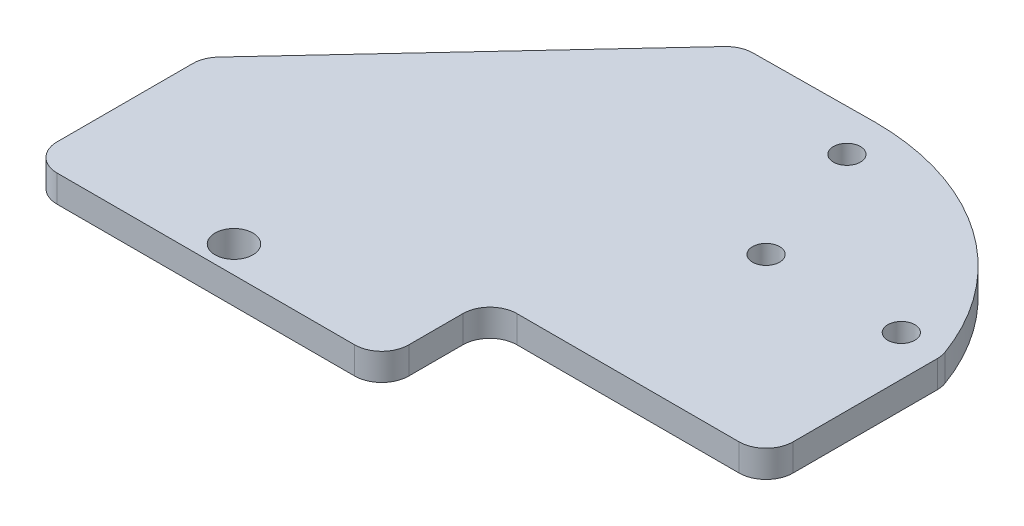
ISO-10303-21;
HEADER;
FILE_DESCRIPTION(('STEP AP214'),'2;1');
FILE_NAME('part.step','',(''),(''),'','','');
FILE_SCHEMA(('AUTOMOTIVE_DESIGN { 1 0 10303 214 1 1 1 1 }'));
ENDSEC;
DATA;
#1=APPLICATION_CONTEXT('core data for automotive mechanical design processes');
#2=APPLICATION_PROTOCOL_DEFINITION('international standard','automotive_design',2000,#1);
#3=PRODUCT_CONTEXT('',#1,'mechanical');
#4=PRODUCT('Part','Part','',(#3));
#5=PRODUCT_RELATED_PRODUCT_CATEGORY('part','',(#4));
#6=PRODUCT_DEFINITION_FORMATION('','',#4);
#7=PRODUCT_DEFINITION_CONTEXT('part definition',#1,'design');
#8=PRODUCT_DEFINITION('design','',#6,#7);
#9=PRODUCT_DEFINITION_SHAPE('','',#8);
#10=(LENGTH_UNIT() NAMED_UNIT(*) SI_UNIT(.MILLI.,.METRE.));
#11=(NAMED_UNIT(*) PLANE_ANGLE_UNIT() SI_UNIT($,.RADIAN.));
#12=(NAMED_UNIT(*) SI_UNIT($,.STERADIAN.) SOLID_ANGLE_UNIT());
#13=UNCERTAINTY_MEASURE_WITH_UNIT(LENGTH_MEASURE(1.E-05),#10,'distance_accuracy_value','');
#14=(GEOMETRIC_REPRESENTATION_CONTEXT(3) GLOBAL_UNCERTAINTY_ASSIGNED_CONTEXT((#13)) GLOBAL_UNIT_ASSIGNED_CONTEXT((#10,
#11,#12)) REPRESENTATION_CONTEXT('',''));
#15=CARTESIAN_POINT('',(0.,0.,0.));
#16=DIRECTION('',(0.,0.,1.));
#17=DIRECTION('',(1.,0.,0.));
#18=AXIS2_PLACEMENT_3D('',#15,#16,#17);
#19=CARTESIAN_POINT('',(-34.7983001151033,10.,-117.080751783085));
#20=DIRECTION('',(0.,-1.,0.));
#21=DIRECTION('',(0.,0.,-1.));
#22=AXIS2_PLACEMENT_3D('',#19,#20,#21);
#23=CYLINDRICAL_SURFACE('',#22,9.99999999999999);
#24=CARTESIAN_POINT('',(-34.7983001151033,0.,-117.080751783085));
#25=DIRECTION('',(0.,1.,0.));
#26=DIRECTION('',(0.,0.,-1.));
#27=AXIS2_PLACEMENT_3D('',#24,#25,#26);
#28=CIRCLE('',#27,9.99999999999999);
#29=CARTESIAN_POINT('',(-34.9535044317094,0.,-127.07954729155));
#30=VERTEX_POINT('',#29);
#31=CARTESIAN_POINT('',(-42.1194135361715,0.,-123.892601625518));
#32=VERTEX_POINT('',#31);
#33=EDGE_CURVE('E177',#30,#32,#28,.T.);
#34=ORIENTED_EDGE('',*,*,#33,.T.);
#35=DIRECTION('',(0.,-1.,0.));
#36=VECTOR('',#35,1.);
#37=CARTESIAN_POINT('',(-42.1194135361715,10.,-123.892601625518));
#38=LINE('',#37,#36);
#39=CARTESIAN_POINT('',(-42.1194135361715,10.,-123.892601625518));
#40=VERTEX_POINT('',#39);
#41=EDGE_CURVE('E11',#40,#32,#38,.T.);
#42=ORIENTED_EDGE('',*,*,#41,.F.);
#43=CARTESIAN_POINT('',(-34.7983001151033,10.,-117.080751783085));
#44=DIRECTION('',(0.,1.,0.));
#45=DIRECTION('',(0.,0.,-1.));
#46=AXIS2_PLACEMENT_3D('',#43,#44,#45);
#47=CIRCLE('',#46,9.99999999999999);
#48=CARTESIAN_POINT('',(-34.9535044317094,10.,-127.07954729155));
#49=VERTEX_POINT('',#48);
#50=EDGE_CURVE('E205',#49,#40,#47,.T.);
#51=ORIENTED_EDGE('',*,*,#50,.F.);
#52=DIRECTION('',(0.,-1.,0.));
#53=VECTOR('',#52,1.);
#54=CARTESIAN_POINT('',(-34.9535044317094,10.,-127.07954729155));
#55=LINE('',#54,#53);
#56=EDGE_CURVE('E173',#49,#30,#55,.T.);
#57=ORIENTED_EDGE('',*,*,#56,.T.);
#58=EDGE_LOOP('',(#34,#42,#51,#57));
#59=FACE_BOUND('',#58,.T.);
#60=ADVANCED_FACE('F37',(#59),#23,.T.);
#61=CARTESIAN_POINT('',(-132.321113421068,10.,-26.9472944173652));
#62=DIRECTION('',(0.732111342106818,0.,0.681184984243307));
#63=DIRECTION('',(0.681184984243307,0.,-0.732111342106818));
#64=AXIS2_PLACEMENT_3D('',#61,#62,#63);
#65=PLANE('',#64);
#66=DIRECTION('',(-0.681184984243307,0.,0.732111342106818));
#67=VECTOR('',#66,1.);
#68=CARTESIAN_POINT('',(-132.321113421068,0.,-26.9472944173652));
#69=LINE('',#68,#67);
#70=CARTESIAN_POINT('',(-132.321113421068,0.,-26.9472944173652));
#71=VERTEX_POINT('',#70);
#72=EDGE_CURVE('E180',#32,#71,#69,.T.);
#73=ORIENTED_EDGE('',*,*,#72,.T.);
#74=DIRECTION('',(0.,-1.,0.));
#75=VECTOR('',#74,1.);
#76=CARTESIAN_POINT('',(-132.321113421068,10.,-26.9472944173652));
#77=LINE('',#76,#75);
#78=CARTESIAN_POINT('',(-132.321113421068,10.,-26.9472944173652));
#79=VERTEX_POINT('',#78);
#80=EDGE_CURVE('E46',#79,#71,#77,.T.);
#81=ORIENTED_EDGE('',*,*,#80,.F.);
#82=DIRECTION('',(-0.681184984243307,0.,0.732111342106818));
#83=VECTOR('',#82,1.);
#84=CARTESIAN_POINT('',(-132.321113421068,10.,-26.9472944173652));
#85=LINE('',#84,#83);
#86=EDGE_CURVE('E119',#40,#79,#85,.T.);
#87=ORIENTED_EDGE('',*,*,#86,.F.);
#88=ORIENTED_EDGE('',*,*,#41,.T.);
#89=EDGE_LOOP('',(#73,#81,#87,#88));
#90=FACE_BOUND('',#89,.T.);
#91=ADVANCED_FACE('F276',(#90),#65,.F.);
#92=CARTESIAN_POINT('',(-125.,10.,-20.1354445749322));
#93=DIRECTION('',(0.,-1.,0.));
#94=DIRECTION('',(0.,0.,-1.));
#95=AXIS2_PLACEMENT_3D('',#92,#93,#94);
#96=CYLINDRICAL_SURFACE('',#95,9.99999999999999);
#97=CARTESIAN_POINT('',(-125.,0.,-20.1354445749322));
#98=DIRECTION('',(0.,1.,0.));
#99=DIRECTION('',(0.,0.,-1.));
#100=AXIS2_PLACEMENT_3D('',#97,#98,#99);
#101=CIRCLE('',#100,9.99999999999999);
#102=CARTESIAN_POINT('',(-135.,0.,-20.1354445749321));
#103=VERTEX_POINT('',#102);
#104=EDGE_CURVE('E182',#71,#103,#101,.T.);
#105=ORIENTED_EDGE('',*,*,#104,.T.);
#106=DIRECTION('',(0.,-1.,0.));
#107=VECTOR('',#106,1.);
#108=CARTESIAN_POINT('',(-135.,10.,-20.1354445749321));
#109=LINE('',#108,#107);
#110=CARTESIAN_POINT('',(-135.,10.,-20.1354445749321));
#111=VERTEX_POINT('',#110);
#112=EDGE_CURVE('E233',#111,#103,#109,.T.);
#113=ORIENTED_EDGE('',*,*,#112,.F.);
#114=CARTESIAN_POINT('',(-125.,10.,-20.1354445749322));
#115=DIRECTION('',(0.,1.,0.));
#116=DIRECTION('',(0.,0.,-1.));
#117=AXIS2_PLACEMENT_3D('',#114,#115,#116);
#118=CIRCLE('',#117,9.99999999999999);
#119=EDGE_CURVE('E408',#79,#111,#118,.T.);
#120=ORIENTED_EDGE('',*,*,#119,.F.);
#121=ORIENTED_EDGE('',*,*,#80,.T.);
#122=EDGE_LOOP('',(#105,#113,#120,#121));
#123=FACE_BOUND('',#122,.T.);
#124=ADVANCED_FACE('F280',(#123),#96,.T.);
#125=CARTESIAN_POINT('',(-135.,10.,30.0000000000002));
#126=DIRECTION('',(1.,0.,0.));
#127=DIRECTION('',(0.,0.,-1.));
#128=AXIS2_PLACEMENT_3D('',#125,#126,#127);
#129=PLANE('',#128);
#130=DIRECTION('',(0.,0.,1.));
#131=VECTOR('',#130,1.);
#132=CARTESIAN_POINT('',(-135.,0.,30.0000000000002));
#133=LINE('',#132,#131);
#134=CARTESIAN_POINT('',(-135.,0.,30.0000000000002));
#135=VERTEX_POINT('',#134);
#136=EDGE_CURVE('E184',#103,#135,#133,.T.);
#137=ORIENTED_EDGE('',*,*,#136,.T.);
#138=DIRECTION('',(0.,-1.,0.));
#139=VECTOR('',#138,1.);
#140=CARTESIAN_POINT('',(-135.,10.,30.0000000000002));
#141=LINE('',#140,#139);
#142=CARTESIAN_POINT('',(-135.,10.,30.0000000000002));
#143=VERTEX_POINT('',#142);
#144=EDGE_CURVE('E230',#143,#135,#141,.T.);
#145=ORIENTED_EDGE('',*,*,#144,.F.);
#146=DIRECTION('',(0.,0.,1.));
#147=VECTOR('',#146,1.);
#148=CARTESIAN_POINT('',(-135.,10.,30.0000000000002));
#149=LINE('',#148,#147);
#150=EDGE_CURVE('E410',#111,#143,#149,.T.);
#151=ORIENTED_EDGE('',*,*,#150,.F.);
#152=ORIENTED_EDGE('',*,*,#112,.T.);
#153=EDGE_LOOP('',(#137,#145,#151,#152));
#154=FACE_BOUND('',#153,.T.);
#155=ADVANCED_FACE('F284',(#154),#129,.F.);
#156=CARTESIAN_POINT('',(-125.,10.,30.0000000000002));
#157=DIRECTION('',(0.,-1.,0.));
#158=DIRECTION('',(0.,0.,-1.));
#159=AXIS2_PLACEMENT_3D('',#156,#157,#158);
#160=CYLINDRICAL_SURFACE('',#159,10.);
#161=CARTESIAN_POINT('',(-125.,0.,30.0000000000002));
#162=DIRECTION('',(0.,1.,0.));
#163=DIRECTION('',(0.,0.,-1.));
#164=AXIS2_PLACEMENT_3D('',#161,#162,#163);
#165=CIRCLE('',#164,10.);
#166=CARTESIAN_POINT('',(-125.,0.,40.0000000000002));
#167=VERTEX_POINT('',#166);
#168=EDGE_CURVE('E186',#135,#167,#165,.T.);
#169=ORIENTED_EDGE('',*,*,#168,.T.);
#170=DIRECTION('',(0.,-1.,0.));
#171=VECTOR('',#170,1.);
#172=CARTESIAN_POINT('',(-125.,10.,40.0000000000002));
#173=LINE('',#172,#171);
#174=CARTESIAN_POINT('',(-125.,10.,40.0000000000002));
#175=VERTEX_POINT('',#174);
#176=EDGE_CURVE('E227',#175,#167,#173,.T.);
#177=ORIENTED_EDGE('',*,*,#176,.F.);
#178=CARTESIAN_POINT('',(-125.,10.,30.0000000000002));
#179=DIRECTION('',(0.,1.,0.));
#180=DIRECTION('',(0.,0.,-1.));
#181=AXIS2_PLACEMENT_3D('',#178,#179,#180);
#182=CIRCLE('',#181,10.);
#183=EDGE_CURVE('E412',#143,#175,#182,.T.);
#184=ORIENTED_EDGE('',*,*,#183,.F.);
#185=ORIENTED_EDGE('',*,*,#144,.T.);
#186=EDGE_LOOP('',(#169,#177,#184,#185));
#187=FACE_BOUND('',#186,.T.);
#188=ADVANCED_FACE('F290',(#187),#160,.T.);
#189=CARTESIAN_POINT('',(-15.0000000000001,10.,40.0000000000002));
#190=DIRECTION('',(0.,0.,-1.));
#191=DIRECTION('',(-1.,0.,0.));
#192=AXIS2_PLACEMENT_3D('',#189,#190,#191);
#193=PLANE('',#192);
#194=DIRECTION('',(1.,0.,0.));
#195=VECTOR('',#194,1.);
#196=CARTESIAN_POINT('',(-15.0000000000001,0.,40.0000000000002));
#197=LINE('',#196,#195);
#198=CARTESIAN_POINT('',(-15.0000000000001,0.,40.0000000000002));
#199=VERTEX_POINT('',#198);
#200=EDGE_CURVE('E188',#167,#199,#197,.T.);
#201=ORIENTED_EDGE('',*,*,#200,.T.);
#202=DIRECTION('',(0.,-1.,0.));
#203=VECTOR('',#202,1.);
#204=CARTESIAN_POINT('',(-15.0000000000001,10.,40.0000000000002));
#205=LINE('',#204,#203);
#206=CARTESIAN_POINT('',(-15.0000000000001,10.,40.0000000000002));
#207=VERTEX_POINT('',#206);
#208=EDGE_CURVE('E224',#207,#199,#205,.T.);
#209=ORIENTED_EDGE('',*,*,#208,.F.);
#210=DIRECTION('',(1.,0.,0.));
#211=VECTOR('',#210,1.);
#212=CARTESIAN_POINT('',(-15.0000000000001,10.,40.0000000000002));
#213=LINE('',#212,#211);
#214=EDGE_CURVE('E414',#175,#207,#213,.T.);
#215=ORIENTED_EDGE('',*,*,#214,.F.);
#216=ORIENTED_EDGE('',*,*,#176,.T.);
#217=EDGE_LOOP('',(#201,#209,#215,#216));
#218=FACE_BOUND('',#217,.T.);
#219=ADVANCED_FACE('F294',(#218),#193,.F.);
#220=CARTESIAN_POINT('',(-15.0000000000001,10.,30.0000000000002));
#221=DIRECTION('',(0.,-1.,0.));
#222=DIRECTION('',(0.,0.,-1.));
#223=AXIS2_PLACEMENT_3D('',#220,#221,#222);
#224=CYLINDRICAL_SURFACE('',#223,10.);
#225=CARTESIAN_POINT('',(-15.0000000000001,0.,30.0000000000002));
#226=DIRECTION('',(0.,1.,0.));
#227=DIRECTION('',(0.,0.,1.));
#228=AXIS2_PLACEMENT_3D('',#225,#226,#227);
#229=CIRCLE('',#228,10.);
#230=CARTESIAN_POINT('',(-5.00000000000007,0.,30.0000000000002));
#231=VERTEX_POINT('',#230);
#232=EDGE_CURVE('E190',#199,#231,#229,.T.);
#233=ORIENTED_EDGE('',*,*,#232,.T.);
#234=DIRECTION('',(0.,-1.,0.));
#235=VECTOR('',#234,1.);
#236=CARTESIAN_POINT('',(-5.00000000000007,10.,30.0000000000002));
#237=LINE('',#236,#235);
#238=CARTESIAN_POINT('',(-5.00000000000007,10.,30.0000000000002));
#239=VERTEX_POINT('',#238);
#240=EDGE_CURVE('E221',#239,#231,#237,.T.);
#241=ORIENTED_EDGE('',*,*,#240,.F.);
#242=CARTESIAN_POINT('',(-15.0000000000001,10.,30.0000000000002));
#243=DIRECTION('',(0.,1.,0.));
#244=DIRECTION('',(0.,0.,1.));
#245=AXIS2_PLACEMENT_3D('',#242,#243,#244);
#246=CIRCLE('',#245,10.);
#247=EDGE_CURVE('E416',#207,#239,#246,.T.);
#248=ORIENTED_EDGE('',*,*,#247,.F.);
#249=ORIENTED_EDGE('',*,*,#208,.T.);
#250=EDGE_LOOP('',(#233,#241,#248,#249));
#251=FACE_BOUND('',#250,.T.);
#252=ADVANCED_FACE('F298',(#251),#224,.T.);
#253=CARTESIAN_POINT('',(-5.00000000000007,10.,10.0000000000001));
#254=DIRECTION('',(-1.,0.,0.));
#255=DIRECTION('',(0.,0.,1.));
#256=AXIS2_PLACEMENT_3D('',#253,#254,#255);
#257=PLANE('',#256);
#258=DIRECTION('',(0.,0.,-1.));
#259=VECTOR('',#258,1.);
#260=CARTESIAN_POINT('',(-5.00000000000007,0.,10.0000000000001));
#261=LINE('',#260,#259);
#262=CARTESIAN_POINT('',(-5.00000000000007,0.,10.0000000000001));
#263=VERTEX_POINT('',#262);
#264=EDGE_CURVE('E192',#231,#263,#261,.T.);
#265=ORIENTED_EDGE('',*,*,#264,.T.);
#266=DIRECTION('',(0.,-1.,0.));
#267=VECTOR('',#266,1.);
#268=CARTESIAN_POINT('',(-5.00000000000007,10.,10.0000000000001));
#269=LINE('',#268,#267);
#270=CARTESIAN_POINT('',(-5.00000000000007,10.,10.0000000000001));
#271=VERTEX_POINT('',#270);
#272=EDGE_CURVE('E218',#271,#263,#269,.T.);
#273=ORIENTED_EDGE('',*,*,#272,.F.);
#274=DIRECTION('',(0.,0.,-1.));
#275=VECTOR('',#274,1.);
#276=CARTESIAN_POINT('',(-5.00000000000007,10.,10.0000000000001));
#277=LINE('',#276,#275);
#278=EDGE_CURVE('E418',#239,#271,#277,.T.);
#279=ORIENTED_EDGE('',*,*,#278,.F.);
#280=ORIENTED_EDGE('',*,*,#240,.T.);
#281=EDGE_LOOP('',(#265,#273,#279,#280));
#282=FACE_BOUND('',#281,.T.);
#283=ADVANCED_FACE('F302',(#282),#257,.F.);
#284=CARTESIAN_POINT('',(4.99999999999992,10.,10.));
#285=DIRECTION('',(0.,-1.,0.));
#286=DIRECTION('',(0.,0.,-1.));
#287=AXIS2_PLACEMENT_3D('',#284,#285,#286);
#288=CYLINDRICAL_SURFACE('',#287,10.);
#289=CARTESIAN_POINT('',(4.99999999999992,0.,10.));
#290=DIRECTION('',(0.,-1.,0.));
#291=DIRECTION('',(0.,0.,-1.));
#292=AXIS2_PLACEMENT_3D('',#289,#290,#291);
#293=CIRCLE('',#292,10.);
#294=CARTESIAN_POINT('',(4.99999999999992,0.,0.));
#295=VERTEX_POINT('',#294);
#296=EDGE_CURVE('E194',#263,#295,#293,.T.);
#297=ORIENTED_EDGE('',*,*,#296,.T.);
#298=DIRECTION('',(0.,-1.,0.));
#299=VECTOR('',#298,1.);
#300=CARTESIAN_POINT('',(4.99999999999992,10.,0.));
#301=LINE('',#300,#299);
#302=CARTESIAN_POINT('',(4.99999999999992,10.,0.));
#303=VERTEX_POINT('',#302);
#304=EDGE_CURVE('E215',#303,#295,#301,.T.);
#305=ORIENTED_EDGE('',*,*,#304,.F.);
#306=CARTESIAN_POINT('',(4.99999999999992,10.,10.));
#307=DIRECTION('',(0.,-1.,0.));
#308=DIRECTION('',(0.,0.,-1.));
#309=AXIS2_PLACEMENT_3D('',#306,#307,#308);
#310=CIRCLE('',#309,10.);
#311=EDGE_CURVE('E420',#271,#303,#310,.T.);
#312=ORIENTED_EDGE('',*,*,#311,.F.);
#313=ORIENTED_EDGE('',*,*,#272,.T.);
#314=EDGE_LOOP('',(#297,#305,#312,#313));
#315=FACE_BOUND('',#314,.T.);
#316=ADVANCED_FACE('F306',(#315),#288,.F.);
#317=CARTESIAN_POINT('',(5.,10.,0.));
#318=DIRECTION('',(0.,0.,-1.));
#319=DIRECTION('',(-1.,0.,0.));
#320=AXIS2_PLACEMENT_3D('',#317,#318,#319);
#321=PLANE('',#320);
#322=DIRECTION('',(1.,0.,0.));
#323=VECTOR('',#322,1.);
#324=CARTESIAN_POINT('',(5.,0.,0.));
#325=LINE('',#324,#323);
#326=CARTESIAN_POINT('',(87.0999999999999,0.,0.));
#327=VERTEX_POINT('',#326);
#328=EDGE_CURVE('E196',#295,#327,#325,.T.);
#329=ORIENTED_EDGE('',*,*,#328,.T.);
#330=DIRECTION('',(0.,-1.,0.));
#331=VECTOR('',#330,1.);
#332=CARTESIAN_POINT('',(87.0999999999999,10.,0.));
#333=LINE('',#332,#331);
#334=CARTESIAN_POINT('',(87.0999999999999,10.,0.));
#335=VERTEX_POINT('',#334);
#336=EDGE_CURVE('E212',#335,#327,#333,.T.);
#337=ORIENTED_EDGE('',*,*,#336,.F.);
#338=DIRECTION('',(1.,0.,0.));
#339=VECTOR('',#338,1.);
#340=CARTESIAN_POINT('',(5.,10.,0.));
#341=LINE('',#340,#339);
#342=EDGE_CURVE('E422',#303,#335,#341,.T.);
#343=ORIENTED_EDGE('',*,*,#342,.F.);
#344=ORIENTED_EDGE('',*,*,#304,.T.);
#345=EDGE_LOOP('',(#329,#337,#343,#344));
#346=FACE_BOUND('',#345,.T.);
#347=ADVANCED_FACE('F310',(#346),#321,.F.);
#348=CARTESIAN_POINT('',(87.1,10.,-10.));
#349=DIRECTION('',(0.,-1.,0.));
#350=DIRECTION('',(0.,0.,-1.));
#351=AXIS2_PLACEMENT_3D('',#348,#349,#350);
#352=CYLINDRICAL_SURFACE('',#351,10.);
#353=CARTESIAN_POINT('',(87.1,0.,-10.));
#354=DIRECTION('',(0.,1.,0.));
#355=DIRECTION('',(0.,0.,1.));
#356=AXIS2_PLACEMENT_3D('',#353,#354,#355);
#357=CIRCLE('',#356,10.);
#358=CARTESIAN_POINT('',(97.1,0.,-10.0000000000001));
#359=VERTEX_POINT('',#358);
#360=EDGE_CURVE('E198',#327,#359,#357,.T.);
#361=ORIENTED_EDGE('',*,*,#360,.T.);
#362=DIRECTION('',(0.,-1.,0.));
#363=VECTOR('',#362,1.);
#364=CARTESIAN_POINT('',(97.1,10.,-10.0000000000001));
#365=LINE('',#364,#363);
#366=CARTESIAN_POINT('',(97.1,10.,-10.0000000000001));
#367=VERTEX_POINT('',#366);
#368=EDGE_CURVE('E209',#367,#359,#365,.T.);
#369=ORIENTED_EDGE('',*,*,#368,.F.);
#370=CARTESIAN_POINT('',(87.1,10.,-10.));
#371=DIRECTION('',(0.,1.,0.));
#372=DIRECTION('',(0.,0.,1.));
#373=AXIS2_PLACEMENT_3D('',#370,#371,#372);
#374=CIRCLE('',#373,10.);
#375=EDGE_CURVE('E424',#335,#367,#374,.T.);
#376=ORIENTED_EDGE('',*,*,#375,.F.);
#377=ORIENTED_EDGE('',*,*,#336,.T.);
#378=EDGE_LOOP('',(#361,#369,#376,#377));
#379=FACE_BOUND('',#378,.T.);
#380=ADVANCED_FACE('F314',(#379),#352,.T.);
#381=CARTESIAN_POINT('',(97.1,10.,-10.0000000000001));
#382=DIRECTION('',(-1.,0.,0.));
#383=DIRECTION('',(0.,0.,1.));
#384=AXIS2_PLACEMENT_3D('',#381,#382,#383);
#385=PLANE('',#384);
#386=DIRECTION('',(0.,0.,-1.));
#387=VECTOR('',#386,1.);
#388=CARTESIAN_POINT('',(97.1,0.,-10.0000000000001));
#389=LINE('',#388,#387);
#390=CARTESIAN_POINT('',(97.1,0.,-63.2972088275292));
#391=VERTEX_POINT('',#390);
#392=EDGE_CURVE('E200',#359,#391,#389,.T.);
#393=ORIENTED_EDGE('',*,*,#392,.T.);
#394=DIRECTION('',(0.,-1.,0.));
#395=VECTOR('',#394,1.);
#396=CARTESIAN_POINT('',(97.1,10.,-63.2972088275292));
#397=LINE('',#396,#395);
#398=CARTESIAN_POINT('',(97.1,10.,-63.2972088275292));
#399=VERTEX_POINT('',#398);
#400=EDGE_CURVE('E168',#399,#391,#397,.T.);
#401=ORIENTED_EDGE('',*,*,#400,.F.);
#402=DIRECTION('',(0.,0.,-1.));
#403=VECTOR('',#402,1.);
#404=CARTESIAN_POINT('',(97.1,10.,-10.0000000000001));
#405=LINE('',#404,#403);
#406=EDGE_CURVE('E159',#367,#399,#405,.T.);
#407=ORIENTED_EDGE('',*,*,#406,.F.);
#408=ORIENTED_EDGE('',*,*,#368,.T.);
#409=EDGE_LOOP('',(#393,#401,#407,#408));
#410=FACE_BOUND('',#409,.T.);
#411=ADVANCED_FACE('F318',(#410),#385,.F.);
#412=CARTESIAN_POINT('',(87.1,10.,-63.2972088275292));
#413=DIRECTION('',(0.,-1.,0.));
#414=DIRECTION('',(0.,0.,-1.));
#415=AXIS2_PLACEMENT_3D('',#412,#413,#414);
#416=CYLINDRICAL_SURFACE('',#415,9.99999999999999);
#417=CARTESIAN_POINT('',(87.1,0.,-63.2972088275292));
#418=DIRECTION('',(0.,1.,0.));
#419=DIRECTION('',(0.,0.,-1.));
#420=AXIS2_PLACEMENT_3D('',#417,#418,#419);
#421=CIRCLE('',#420,9.99999999999999);
#422=CARTESIAN_POINT('',(96.5026593383159,0.,-66.70161734702));
#423=VERTEX_POINT('',#422);
#424=EDGE_CURVE('E167',#391,#423,#421,.T.);
#425=ORIENTED_EDGE('',*,*,#424,.T.);
#426=DIRECTION('',(0.,-1.,0.));
#427=VECTOR('',#426,1.);
#428=CARTESIAN_POINT('',(96.5026593383159,10.,-66.70161734702));
#429=LINE('',#428,#427);
#430=CARTESIAN_POINT('',(96.5026593383159,10.,-66.70161734702));
#431=VERTEX_POINT('',#430);
#432=EDGE_CURVE('E164',#431,#423,#429,.T.);
#433=ORIENTED_EDGE('',*,*,#432,.F.);
#434=CARTESIAN_POINT('',(87.1,10.,-63.2972088275292));
#435=DIRECTION('',(0.,1.,0.));
#436=DIRECTION('',(0.,0.,-1.));
#437=AXIS2_PLACEMENT_3D('',#434,#435,#436);
#438=CIRCLE('',#437,9.99999999999999);
#439=EDGE_CURVE('E153',#399,#431,#438,.T.);
#440=ORIENTED_EDGE('',*,*,#439,.F.);
#441=ORIENTED_EDGE('',*,*,#400,.T.);
#442=EDGE_LOOP('',(#425,#433,#440,#441));
#443=FACE_BOUND('',#442,.T.);
#444=ADVANCED_FACE('F165',(#443),#416,.T.);
#445=CARTESIAN_POINT('',(9.82826310663928,10.,-35.3195325201867));
#446=DIRECTION('',(0.,-1.,0.));
#447=DIRECTION('',(0.,0.,-1.));
#448=AXIS2_PLACEMENT_3D('',#445,#446,#447);
#449=CYLINDRICAL_SURFACE('',#448,92.1807258064517);
#450=CARTESIAN_POINT('',(9.82826310663928,0.,-35.3195325201867));
#451=DIRECTION('',(0.,1.,0.));
#452=DIRECTION('',(0.,0.,-1.));
#453=AXIS2_PLACEMENT_3D('',#450,#451,#452);
#454=CIRCLE('',#453,92.1807258064517);
#455=CARTESIAN_POINT('',(10.0464955682906,0.,-127.5));
#456=VERTEX_POINT('',#455);
#457=EDGE_CURVE('E105',#423,#456,#454,.T.);
#458=ORIENTED_EDGE('',*,*,#457,.T.);
#459=DIRECTION('',(0.,-1.,0.));
#460=VECTOR('',#459,1.);
#461=CARTESIAN_POINT('',(10.0464955682906,10.,-127.5));
#462=LINE('',#461,#460);
#463=CARTESIAN_POINT('',(10.0464955682906,10.,-127.5));
#464=VERTEX_POINT('',#463);
#465=EDGE_CURVE('E169',#464,#456,#462,.T.);
#466=ORIENTED_EDGE('',*,*,#465,.F.);
#467=CARTESIAN_POINT('',(9.82826310663928,10.,-35.3195325201867));
#468=DIRECTION('',(0.,1.,0.));
#469=DIRECTION('',(0.,0.,-1.));
#470=AXIS2_PLACEMENT_3D('',#467,#468,#469);
#471=CIRCLE('',#470,92.1807258064517);
#472=EDGE_CURVE('E157',#431,#464,#471,.T.);
#473=ORIENTED_EDGE('',*,*,#472,.F.);
#474=ORIENTED_EDGE('',*,*,#432,.T.);
#475=EDGE_LOOP('',(#458,#466,#473,#474));
#476=FACE_BOUND('',#475,.T.);
#477=ADVANCED_FACE('F171',(#476),#449,.T.);
#478=CARTESIAN_POINT('',(-34.9535044317094,10.,-127.07954729155));
#479=DIRECTION('',(0.00934298571333686,0.,0.999956353356466));
#480=DIRECTION('',(0.999956353356466,0.,-0.00934298571333686));
#481=AXIS2_PLACEMENT_3D('',#478,#479,#480);
#482=PLANE('',#481);
#483=DIRECTION('',(-0.999956353356465,0.,0.00934298571333686));
#484=VECTOR('',#483,1.);
#485=CARTESIAN_POINT('',(-34.9535044317094,0.,-127.07954729155));
#486=LINE('',#485,#484);
#487=EDGE_CURVE('E111',#456,#30,#486,.T.);
#488=ORIENTED_EDGE('',*,*,#487,.T.);
#489=ORIENTED_EDGE('',*,*,#56,.F.);
#490=DIRECTION('',(-0.999956353356465,0.,0.00934298571333686));
#491=VECTOR('',#490,1.);
#492=CARTESIAN_POINT('',(-34.9535044317094,10.,-127.07954729155));
#493=LINE('',#492,#491);
#494=EDGE_CURVE('E55',#464,#49,#493,.T.);
#495=ORIENTED_EDGE('',*,*,#494,.F.);
#496=ORIENTED_EDGE('',*,*,#465,.T.);
#497=EDGE_LOOP('',(#488,#489,#495,#496));
#498=FACE_BOUND('',#497,.T.);
#499=ADVANCED_FACE('F265',(#498),#482,.F.);
#500=CARTESIAN_POINT('',(-34.7983001151033,10.,-117.080751783085));
#501=DIRECTION('',(0.,-1.,0.));
#502=DIRECTION('',(0.,0.,-1.));
#503=AXIS2_PLACEMENT_3D('',#500,#501,#502);
#504=PLANE('',#503);
#505=CARTESIAN_POINT('',(-69.6153846153847,10.,30.0000000000002));
#506=DIRECTION('',(0.,-1.,0.));
#507=DIRECTION('',(0.,0.,-1.));
#508=AXIS2_PLACEMENT_3D('',#505,#506,#507);
#509=CIRCLE('',#508,7.);
#510=CARTESIAN_POINT('',(-69.6153846153847,10.,23.0000000000002));
#511=VERTEX_POINT('',#510);
#512=EDGE_CURVE('E391',#511,#511,#509,.T.);
#513=ORIENTED_EDGE('',*,*,#512,.T.);
#514=EDGE_LOOP('',(#513));
#515=FACE_BOUND('',#514,.T.);
#516=CARTESIAN_POINT('',(14.9989928337167,10.,-111.984631039295));
#517=DIRECTION('',(0.,1.,0.));
#518=DIRECTION('',(0.,0.,1.));
#519=AXIS2_PLACEMENT_3D('',#516,#517,#518);
#520=CIRCLE('',#519,5.00000000000001);
#521=CARTESIAN_POINT('',(14.9989928337167,10.,-106.984631039295));
#522=VERTEX_POINT('',#521);
#523=EDGE_CURVE('E241',#522,#522,#520,.T.);
#524=ORIENTED_EDGE('',*,*,#523,.F.);
#525=EDGE_LOOP('',(#524));
#526=FACE_BOUND('',#525,.T.);
#527=CARTESIAN_POINT('',(82.1,10.,-65.));
#528=DIRECTION('',(0.,1.,0.));
#529=DIRECTION('',(0.,0.,1.));
#530=AXIS2_PLACEMENT_3D('',#527,#528,#529);
#531=CIRCLE('',#530,5.00000000000001);
#532=CARTESIAN_POINT('',(82.1,10.,-60.));
#533=VERTEX_POINT('',#532);
#534=EDGE_CURVE('E401',#533,#533,#531,.T.);
#535=ORIENTED_EDGE('',*,*,#534,.F.);
#536=EDGE_LOOP('',(#535));
#537=FACE_BOUND('',#536,.T.);
#538=CARTESIAN_POINT('',(32.1,10.,-65.));
#539=DIRECTION('',(0.,1.,0.));
#540=DIRECTION('',(0.,0.,1.));
#541=AXIS2_PLACEMENT_3D('',#538,#539,#540);
#542=CIRCLE('',#541,4.99999999999999);
#543=CARTESIAN_POINT('',(32.1,10.,-60.));
#544=VERTEX_POINT('',#543);
#545=EDGE_CURVE('E396',#544,#544,#542,.T.);
#546=ORIENTED_EDGE('',*,*,#545,.F.);
#547=EDGE_LOOP('',(#546));
#548=FACE_BOUND('',#547,.T.);
#549=ORIENTED_EDGE('',*,*,#50,.T.);
#550=ORIENTED_EDGE('',*,*,#86,.T.);
#551=ORIENTED_EDGE('',*,*,#119,.T.);
#552=ORIENTED_EDGE('',*,*,#150,.T.);
#553=ORIENTED_EDGE('',*,*,#183,.T.);
#554=ORIENTED_EDGE('',*,*,#214,.T.);
#555=ORIENTED_EDGE('',*,*,#247,.T.);
#556=ORIENTED_EDGE('',*,*,#278,.T.);
#557=ORIENTED_EDGE('',*,*,#311,.T.);
#558=ORIENTED_EDGE('',*,*,#342,.T.);
#559=ORIENTED_EDGE('',*,*,#375,.T.);
#560=ORIENTED_EDGE('',*,*,#406,.T.);
#561=ORIENTED_EDGE('',*,*,#439,.T.);
#562=ORIENTED_EDGE('',*,*,#472,.T.);
#563=ORIENTED_EDGE('',*,*,#494,.T.);
#564=EDGE_LOOP('',(#549,#550,#551,#552,#553,#554,#555,#556,#557,#558,#559,#560,#561,#562,#563));
#565=FACE_BOUND('',#564,.T.);
#566=ADVANCED_FACE('F155',(#515,#526,#537,#548,#565),#504,.F.);
#567=CARTESIAN_POINT('',(-34.7983001151033,0.,-117.080751783085));
#568=DIRECTION('',(0.,-1.,0.));
#569=DIRECTION('',(0.,0.,-1.));
#570=AXIS2_PLACEMENT_3D('',#567,#568,#569);
#571=PLANE('',#570);
#572=CARTESIAN_POINT('',(-69.6153846153847,0.,30.0000000000002));
#573=DIRECTION('',(0.,-1.,0.));
#574=DIRECTION('',(0.,0.,-1.));
#575=AXIS2_PLACEMENT_3D('',#572,#573,#574);
#576=CIRCLE('',#575,7.);
#577=CARTESIAN_POINT('',(-69.6153846153847,0.,23.0000000000002));
#578=VERTEX_POINT('',#577);
#579=EDGE_CURVE('E394',#578,#578,#576,.T.);
#580=ORIENTED_EDGE('',*,*,#579,.F.);
#581=EDGE_LOOP('',(#580));
#582=FACE_BOUND('',#581,.T.);
#583=CARTESIAN_POINT('',(14.9989928337167,0.,-111.984631039295));
#584=DIRECTION('',(0.,-1.,0.));
#585=DIRECTION('',(0.,0.,-1.));
#586=AXIS2_PLACEMENT_3D('',#583,#584,#585);
#587=CIRCLE('',#586,5.00000000000001);
#588=CARTESIAN_POINT('',(14.9989928337167,0.,-116.984631039295));
#589=VERTEX_POINT('',#588);
#590=EDGE_CURVE('E40',#589,#589,#587,.T.);
#591=ORIENTED_EDGE('',*,*,#590,.F.);
#592=EDGE_LOOP('',(#591));
#593=FACE_BOUND('',#592,.T.);
#594=CARTESIAN_POINT('',(82.1,0.,-65.));
#595=DIRECTION('',(0.,-1.,0.));
#596=DIRECTION('',(0.,0.,-1.));
#597=AXIS2_PLACEMENT_3D('',#594,#595,#596);
#598=CIRCLE('',#597,5.00000000000001);
#599=CARTESIAN_POINT('',(82.1,0.,-70.));
#600=VERTEX_POINT('',#599);
#601=EDGE_CURVE('E240',#600,#600,#598,.T.);
#602=ORIENTED_EDGE('',*,*,#601,.F.);
#603=EDGE_LOOP('',(#602));
#604=FACE_BOUND('',#603,.T.);
#605=CARTESIAN_POINT('',(32.1,0.,-65.));
#606=DIRECTION('',(0.,-1.,0.));
#607=DIRECTION('',(0.,0.,-1.));
#608=AXIS2_PLACEMENT_3D('',#605,#606,#607);
#609=CIRCLE('',#608,4.99999999999999);
#610=CARTESIAN_POINT('',(32.1,0.,-70.));
#611=VERTEX_POINT('',#610);
#612=EDGE_CURVE('E238',#611,#611,#609,.T.);
#613=ORIENTED_EDGE('',*,*,#612,.F.);
#614=EDGE_LOOP('',(#613));
#615=FACE_BOUND('',#614,.T.);
#616=ORIENTED_EDGE('',*,*,#33,.F.);
#617=ORIENTED_EDGE('',*,*,#487,.F.);
#618=ORIENTED_EDGE('',*,*,#457,.F.);
#619=ORIENTED_EDGE('',*,*,#424,.F.);
#620=ORIENTED_EDGE('',*,*,#392,.F.);
#621=ORIENTED_EDGE('',*,*,#360,.F.);
#622=ORIENTED_EDGE('',*,*,#328,.F.);
#623=ORIENTED_EDGE('',*,*,#296,.F.);
#624=ORIENTED_EDGE('',*,*,#264,.F.);
#625=ORIENTED_EDGE('',*,*,#232,.F.);
#626=ORIENTED_EDGE('',*,*,#200,.F.);
#627=ORIENTED_EDGE('',*,*,#168,.F.);
#628=ORIENTED_EDGE('',*,*,#136,.F.);
#629=ORIENTED_EDGE('',*,*,#104,.F.);
#630=ORIENTED_EDGE('',*,*,#72,.F.);
#631=EDGE_LOOP('',(#616,#617,#618,#619,#620,#621,#622,#623,#624,#625,#626,#627,#628,#629,#630));
#632=FACE_BOUND('',#631,.T.);
#633=ADVANCED_FACE('F251',(#582,#593,#604,#615,#632),#571,.T.);
#634=CARTESIAN_POINT('',(32.1,-1.2E-05,-65.));
#635=DIRECTION('',(0.,1.,0.));
#636=DIRECTION('',(0.,0.,1.));
#637=AXIS2_PLACEMENT_3D('',#634,#635,#636);
#638=CYLINDRICAL_SURFACE('',#637,4.99999999999999);
#639=ORIENTED_EDGE('',*,*,#612,.T.);
#640=EDGE_LOOP('',(#639));
#641=FACE_BOUND('',#640,.T.);
#642=ORIENTED_EDGE('',*,*,#545,.T.);
#643=EDGE_LOOP('',(#642));
#644=FACE_BOUND('',#643,.T.);
#645=ADVANCED_FACE('F254',(#641,#644),#638,.F.);
#646=CARTESIAN_POINT('',(82.1,-1.2E-05,-65.));
#647=DIRECTION('',(0.,1.,0.));
#648=DIRECTION('',(0.,0.,1.));
#649=AXIS2_PLACEMENT_3D('',#646,#647,#648);
#650=CYLINDRICAL_SURFACE('',#649,5.00000000000001);
#651=ORIENTED_EDGE('',*,*,#601,.T.);
#652=EDGE_LOOP('',(#651));
#653=FACE_BOUND('',#652,.T.);
#654=ORIENTED_EDGE('',*,*,#534,.T.);
#655=EDGE_LOOP('',(#654));
#656=FACE_BOUND('',#655,.T.);
#657=ADVANCED_FACE('F346',(#653,#656),#650,.F.);
#658=CARTESIAN_POINT('',(14.9989928337167,-1.2E-05,-111.984631039295));
#659=DIRECTION('',(0.,1.,0.));
#660=DIRECTION('',(0.,0.,1.));
#661=AXIS2_PLACEMENT_3D('',#658,#659,#660);
#662=CYLINDRICAL_SURFACE('',#661,5.00000000000001);
#663=ORIENTED_EDGE('',*,*,#590,.T.);
#664=EDGE_LOOP('',(#663));
#665=FACE_BOUND('',#664,.T.);
#666=ORIENTED_EDGE('',*,*,#523,.T.);
#667=EDGE_LOOP('',(#666));
#668=FACE_BOUND('',#667,.T.);
#669=ADVANCED_FACE('F248',(#665,#668),#662,.F.);
#670=CARTESIAN_POINT('',(-69.6153846153847,10.,30.0000000000002));
#671=DIRECTION('',(0.,-1.,0.));
#672=DIRECTION('',(0.,0.,-1.));
#673=AXIS2_PLACEMENT_3D('',#670,#671,#672);
#674=CYLINDRICAL_SURFACE('',#673,7.);
#675=ORIENTED_EDGE('',*,*,#512,.F.);
#676=EDGE_LOOP('',(#675));
#677=FACE_BOUND('',#676,.T.);
#678=ORIENTED_EDGE('',*,*,#579,.T.);
#679=EDGE_LOOP('',(#678));
#680=FACE_BOUND('',#679,.T.);
#681=ADVANCED_FACE('F365',(#677,#680),#674,.F.);
#682=CLOSED_SHELL('',(#60,#91,#124,#155,#188,#219,#252,#283,#316,#347,#380,#411,#444,#477,#499,
#566,#633,#645,#657,#669,#681));
#683=MANIFOLD_SOLID_BREP('B2',#682);
#684=ADVANCED_BREP_SHAPE_REPRESENTATION('',(#18,#683),#14);
#685=SHAPE_DEFINITION_REPRESENTATION(#9,#684);
ENDSEC;
END-ISO-10303-21;
